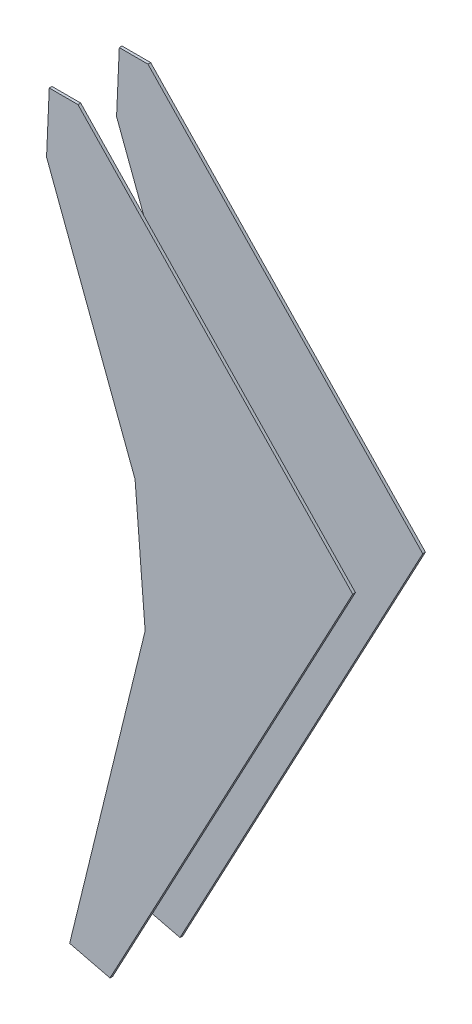
ISO-10303-21;
HEADER;
FILE_DESCRIPTION(('STEP AP214'),'2;1');
FILE_NAME('part.step','',(''),(''),'','','');
FILE_SCHEMA(('AUTOMOTIVE_DESIGN { 1 0 10303 214 1 1 1 1 }'));
ENDSEC;
DATA;
#1=APPLICATION_CONTEXT('core data for automotive mechanical design processes');
#2=APPLICATION_PROTOCOL_DEFINITION('international standard','automotive_design',2000,#1);
#3=PRODUCT_CONTEXT('',#1,'mechanical');
#4=PRODUCT('Part','Part','',(#3));
#5=PRODUCT_RELATED_PRODUCT_CATEGORY('part','',(#4));
#6=PRODUCT_DEFINITION_FORMATION('','',#4);
#7=PRODUCT_DEFINITION_CONTEXT('part definition',#1,'design');
#8=PRODUCT_DEFINITION('design','',#6,#7);
#9=PRODUCT_DEFINITION_SHAPE('','',#8);
#10=(LENGTH_UNIT() NAMED_UNIT(*) SI_UNIT(.MILLI.,.METRE.));
#11=(NAMED_UNIT(*) PLANE_ANGLE_UNIT() SI_UNIT($,.RADIAN.));
#12=(NAMED_UNIT(*) SI_UNIT($,.STERADIAN.) SOLID_ANGLE_UNIT());
#13=UNCERTAINTY_MEASURE_WITH_UNIT(LENGTH_MEASURE(1.E-05),#10,'distance_accuracy_value','');
#14=(GEOMETRIC_REPRESENTATION_CONTEXT(3) GLOBAL_UNCERTAINTY_ASSIGNED_CONTEXT((#13)) GLOBAL_UNIT_ASSIGNED_CONTEXT((#10,
#11,#12)) REPRESENTATION_CONTEXT('',''));
#15=CARTESIAN_POINT('',(0.,0.,0.));
#16=DIRECTION('',(0.,0.,1.));
#17=DIRECTION('',(1.,0.,0.));
#18=AXIS2_PLACEMENT_3D('',#15,#16,#17);
#19=CARTESIAN_POINT('',(-290.413622868876,715.062577472868,-70.25));
#20=DIRECTION('',(0.,1.,0.));
#21=DIRECTION('',(0.,0.,1.));
#22=AXIS2_PLACEMENT_3D('',#19,#20,#21);
#23=PLANE('',#22);
#24=DIRECTION('',(-1.,0.,0.));
#25=VECTOR('',#24,1.);
#26=CARTESIAN_POINT('',(-290.413622868876,715.062577472868,-65.));
#27=LINE('',#26,#25);
#28=CARTESIAN_POINT('',(-235.091721204549,715.062577472868,-65.));
#29=VERTEX_POINT('',#28);
#30=CARTESIAN_POINT('',(-290.413622868876,715.062577472868,-65.));
#31=VERTEX_POINT('',#30);
#32=EDGE_CURVE('E152',#29,#31,#27,.T.);
#33=ORIENTED_EDGE('',*,*,#32,.F.);
#34=DIRECTION('',(0.,0.,1.));
#35=VECTOR('',#34,1.);
#36=CARTESIAN_POINT('',(-235.091721204549,715.062577472868,-70.25));
#37=LINE('',#36,#35);
#38=CARTESIAN_POINT('',(-235.091721204549,715.062577472868,-70.25));
#39=VERTEX_POINT('',#38);
#40=EDGE_CURVE('E12',#39,#29,#37,.T.);
#41=ORIENTED_EDGE('',*,*,#40,.F.);
#42=DIRECTION('',(-1.,0.,0.));
#43=VECTOR('',#42,1.);
#44=CARTESIAN_POINT('',(-290.413622868876,715.062577472868,-70.25));
#45=LINE('',#44,#43);
#46=CARTESIAN_POINT('',(-290.413622868876,715.062577472868,-70.25));
#47=VERTEX_POINT('',#46);
#48=EDGE_CURVE('E180',#39,#47,#45,.T.);
#49=ORIENTED_EDGE('',*,*,#48,.T.);
#50=DIRECTION('',(0.,0.,1.));
#51=VECTOR('',#50,1.);
#52=CARTESIAN_POINT('',(-290.413622868876,715.062577472868,-70.25));
#53=LINE('',#52,#51);
#54=EDGE_CURVE('E52',#47,#31,#53,.T.);
#55=ORIENTED_EDGE('',*,*,#54,.T.);
#56=EDGE_LOOP('',(#33,#41,#49,#55));
#57=FACE_BOUND('',#56,.T.);
#58=ADVANCED_FACE('F49',(#57),#23,.T.);
#59=CARTESIAN_POINT('',(295.675074254291,161.480188614972,-70.25));
#60=DIRECTION('',(0.721825121904725,0.692075496883995,0.));
#61=DIRECTION('',(-0.692075496883995,0.721825121904725,0.));
#62=AXIS2_PLACEMENT_3D('',#59,#60,#61);
#63=PLANE('',#62);
#64=DIRECTION('',(-0.692075496883995,0.721825121904725,0.));
#65=VECTOR('',#64,1.);
#66=CARTESIAN_POINT('',(295.675074254291,161.480188614972,-65.));
#67=LINE('',#66,#65);
#68=CARTESIAN_POINT('',(295.675074254291,161.480188614972,-65.));
#69=VERTEX_POINT('',#68);
#70=EDGE_CURVE('E177',#69,#29,#67,.T.);
#71=ORIENTED_EDGE('',*,*,#70,.F.);
#72=DIRECTION('',(0.,0.,1.));
#73=VECTOR('',#72,1.);
#74=CARTESIAN_POINT('',(295.675074254291,161.480188614972,-70.25));
#75=LINE('',#74,#73);
#76=CARTESIAN_POINT('',(295.675074254291,161.480188614972,-70.25));
#77=VERTEX_POINT('',#76);
#78=EDGE_CURVE('E59',#77,#69,#75,.T.);
#79=ORIENTED_EDGE('',*,*,#78,.F.);
#80=DIRECTION('',(-0.692075496883995,0.721825121904725,0.));
#81=VECTOR('',#80,1.);
#82=CARTESIAN_POINT('',(295.675074254291,161.480188614972,-70.25));
#83=LINE('',#82,#81);
#84=EDGE_CURVE('E138',#77,#39,#83,.T.);
#85=ORIENTED_EDGE('',*,*,#84,.T.);
#86=ORIENTED_EDGE('',*,*,#40,.T.);
#87=EDGE_LOOP('',(#71,#79,#85,#86));
#88=FACE_BOUND('',#87,.T.);
#89=ADVANCED_FACE('F198',(#88),#63,.T.);
#90=CARTESIAN_POINT('',(-173.202657587621,-715.062577472868,-70.25));
#91=DIRECTION('',(0.881772393414626,-0.471675149029332,0.));
#92=DIRECTION('',(0.471675149029332,0.881772393414626,0.));
#93=AXIS2_PLACEMENT_3D('',#90,#91,#92);
#94=PLANE('',#93);
#95=DIRECTION('',(0.471675149029332,0.881772393414626,0.));
#96=VECTOR('',#95,1.);
#97=CARTESIAN_POINT('',(-173.202657587621,-715.062577472868,-65.));
#98=LINE('',#97,#96);
#99=CARTESIAN_POINT('',(-173.202657587621,-715.062577472868,-65.));
#100=VERTEX_POINT('',#99);
#101=EDGE_CURVE('E124',#100,#69,#98,.T.);
#102=ORIENTED_EDGE('',*,*,#101,.F.);
#103=DIRECTION('',(0.,0.,1.));
#104=VECTOR('',#103,1.);
#105=CARTESIAN_POINT('',(-173.202657587621,-715.062577472868,-70.25));
#106=LINE('',#105,#104);
#107=CARTESIAN_POINT('',(-173.202657587621,-715.062577472868,-70.25));
#108=VERTEX_POINT('',#107);
#109=EDGE_CURVE('E119',#108,#100,#106,.T.);
#110=ORIENTED_EDGE('',*,*,#109,.F.);
#111=DIRECTION('',(0.471675149029332,0.881772393414626,0.));
#112=VECTOR('',#111,1.);
#113=CARTESIAN_POINT('',(-173.202657587621,-715.062577472868,-70.25));
#114=LINE('',#113,#112);
#115=EDGE_CURVE('E122',#108,#77,#114,.T.);
#116=ORIENTED_EDGE('',*,*,#115,.T.);
#117=ORIENTED_EDGE('',*,*,#78,.T.);
#118=EDGE_LOOP('',(#102,#110,#116,#117));
#119=FACE_BOUND('',#118,.T.);
#120=ADVANCED_FACE('F121',(#119),#94,.T.);
#121=CARTESIAN_POINT('',(-251.026677890345,-696.013410022108,-70.25));
#122=DIRECTION('',(-0.237753613248927,-0.971325496106779,0.));
#123=DIRECTION('',(0.971325496106779,-0.237753613248927,0.));
#124=AXIS2_PLACEMENT_3D('',#121,#122,#123);
#125=PLANE('',#124);
#126=DIRECTION('',(0.971325496106779,-0.237753613248927,0.));
#127=VECTOR('',#126,1.);
#128=CARTESIAN_POINT('',(-251.026677890345,-696.013410022108,-65.));
#129=LINE('',#128,#127);
#130=CARTESIAN_POINT('',(-251.026677890345,-696.013410022108,-65.));
#131=VERTEX_POINT('',#130);
#132=EDGE_CURVE('E172',#131,#100,#129,.T.);
#133=ORIENTED_EDGE('',*,*,#132,.F.);
#134=DIRECTION('',(0.,0.,1.));
#135=VECTOR('',#134,1.);
#136=CARTESIAN_POINT('',(-251.026677890345,-696.013410022108,-70.25));
#137=LINE('',#136,#135);
#138=CARTESIAN_POINT('',(-251.026677890345,-696.013410022108,-70.25));
#139=VERTEX_POINT('',#138);
#140=EDGE_CURVE('E130',#139,#131,#137,.T.);
#141=ORIENTED_EDGE('',*,*,#140,.F.);
#142=DIRECTION('',(0.971325496106779,-0.237753613248927,0.));
#143=VECTOR('',#142,1.);
#144=CARTESIAN_POINT('',(-251.026677890345,-696.013410022108,-70.25));
#145=LINE('',#144,#143);
#146=EDGE_CURVE('E136',#139,#108,#145,.T.);
#147=ORIENTED_EDGE('',*,*,#146,.T.);
#148=ORIENTED_EDGE('',*,*,#109,.T.);
#149=EDGE_LOOP('',(#133,#141,#147,#148));
#150=FACE_BOUND('',#149,.T.);
#151=ADVANCED_FACE('F141',(#150),#125,.T.);
#152=CARTESIAN_POINT('',(-251.026677890345,-696.013410022108,-70.25));
#153=DIRECTION('',(-0.971325496106777,0.237753613248932,0.));
#154=DIRECTION('',(-0.237753613248933,-0.971325496106777,0.));
#155=AXIS2_PLACEMENT_3D('',#152,#153,#154);
#156=PLANE('',#155);
#157=DIRECTION('',(-0.237753613248932,-0.971325496106777,0.));
#158=VECTOR('',#157,1.);
#159=CARTESIAN_POINT('',(-251.026677890345,-696.013410022108,-65.));
#160=LINE('',#159,#158);
#161=CARTESIAN_POINT('',(-105.228202031788,-100.364094919385,-65.));
#162=VERTEX_POINT('',#161);
#163=EDGE_CURVE('E168',#162,#131,#160,.T.);
#164=ORIENTED_EDGE('',*,*,#163,.F.);
#165=DIRECTION('',(0.,0.,1.));
#166=VECTOR('',#165,1.);
#167=CARTESIAN_POINT('',(-105.228202031788,-100.364094919385,-70.25));
#168=LINE('',#167,#166);
#169=CARTESIAN_POINT('',(-105.228202031788,-100.364094919385,-70.25));
#170=VERTEX_POINT('',#169);
#171=EDGE_CURVE('E186',#170,#162,#168,.T.);
#172=ORIENTED_EDGE('',*,*,#171,.F.);
#173=DIRECTION('',(-0.237753613248932,-0.971325496106777,0.));
#174=VECTOR('',#173,1.);
#175=CARTESIAN_POINT('',(-251.026677890345,-696.013410022108,-70.25));
#176=LINE('',#175,#174);
#177=EDGE_CURVE('E143',#170,#139,#176,.T.);
#178=ORIENTED_EDGE('',*,*,#177,.T.);
#179=ORIENTED_EDGE('',*,*,#140,.T.);
#180=EDGE_LOOP('',(#164,#172,#178,#179));
#181=FACE_BOUND('',#180,.T.);
#182=ADVANCED_FACE('F211',(#181),#156,.T.);
#183=CARTESIAN_POINT('',(-124.723344844375,143.447345429365,-70.25));
#184=DIRECTION('',(-0.996818453765809,-0.0797055219664389,0.));
#185=DIRECTION('',(0.0797055219664389,-0.996818453765809,0.));
#186=AXIS2_PLACEMENT_3D('',#183,#184,#185);
#187=PLANE('',#186);
#188=DIRECTION('',(0.0797055219664389,-0.996818453765809,0.));
#189=VECTOR('',#188,1.);
#190=CARTESIAN_POINT('',(-124.723344844375,143.447345429365,-65.));
#191=LINE('',#190,#189);
#192=CARTESIAN_POINT('',(-124.723344844375,143.447345429365,-65.));
#193=VERTEX_POINT('',#192);
#194=EDGE_CURVE('E164',#193,#162,#191,.T.);
#195=ORIENTED_EDGE('',*,*,#194,.F.);
#196=DIRECTION('',(0.,0.,1.));
#197=VECTOR('',#196,1.);
#198=CARTESIAN_POINT('',(-124.723344844375,143.447345429365,-70.25));
#199=LINE('',#198,#197);
#200=CARTESIAN_POINT('',(-124.723344844375,143.447345429365,-70.25));
#201=VERTEX_POINT('',#200);
#202=EDGE_CURVE('E189',#201,#193,#199,.T.);
#203=ORIENTED_EDGE('',*,*,#202,.F.);
#204=DIRECTION('',(0.0797055219664389,-0.996818453765809,0.));
#205=VECTOR('',#204,1.);
#206=CARTESIAN_POINT('',(-124.723344844375,143.447345429365,-70.25));
#207=LINE('',#206,#205);
#208=EDGE_CURVE('E146',#201,#170,#207,.T.);
#209=ORIENTED_EDGE('',*,*,#208,.T.);
#210=ORIENTED_EDGE('',*,*,#171,.T.);
#211=EDGE_LOOP('',(#195,#203,#209,#210));
#212=FACE_BOUND('',#211,.T.);
#213=ADVANCED_FACE('F214',(#212),#187,.T.);
#214=CARTESIAN_POINT('',(-295.675074254291,596.92144357392,-70.25));
#215=DIRECTION('',(-0.935717929687217,-0.352749140412656,0.));
#216=DIRECTION('',(0.352749140412656,-0.935717929687217,0.));
#217=AXIS2_PLACEMENT_3D('',#214,#215,#216);
#218=PLANE('',#217);
#219=DIRECTION('',(0.352749140412656,-0.935717929687217,0.));
#220=VECTOR('',#219,1.);
#221=CARTESIAN_POINT('',(-295.675074254291,596.92144357392,-65.));
#222=LINE('',#221,#220);
#223=CARTESIAN_POINT('',(-295.675074254291,596.92144357392,-65.));
#224=VERTEX_POINT('',#223);
#225=EDGE_CURVE('E160',#224,#193,#222,.T.);
#226=ORIENTED_EDGE('',*,*,#225,.F.);
#227=DIRECTION('',(0.,0.,1.));
#228=VECTOR('',#227,1.);
#229=CARTESIAN_POINT('',(-295.675074254291,596.92144357392,-70.25));
#230=LINE('',#229,#228);
#231=CARTESIAN_POINT('',(-295.675074254291,596.92144357392,-70.25));
#232=VERTEX_POINT('',#231);
#233=EDGE_CURVE('E191',#232,#224,#230,.T.);
#234=ORIENTED_EDGE('',*,*,#233,.F.);
#235=DIRECTION('',(0.352749140412656,-0.935717929687217,0.));
#236=VECTOR('',#235,1.);
#237=CARTESIAN_POINT('',(-295.675074254291,596.92144357392,-70.25));
#238=LINE('',#237,#236);
#239=EDGE_CURVE('E289',#232,#201,#238,.T.);
#240=ORIENTED_EDGE('',*,*,#239,.T.);
#241=ORIENTED_EDGE('',*,*,#202,.T.);
#242=EDGE_LOOP('',(#226,#234,#240,#241));
#243=FACE_BOUND('',#242,.T.);
#244=ADVANCED_FACE('F218',(#243),#218,.T.);
#245=CARTESIAN_POINT('',(-295.675074254291,596.92144357392,-70.25));
#246=DIRECTION('',(-0.999009776080988,0.0444912046882872,0.));
#247=DIRECTION('',(-0.0444912046882872,-0.999009776080988,0.));
#248=AXIS2_PLACEMENT_3D('',#245,#246,#247);
#249=PLANE('',#248);
#250=DIRECTION('',(-0.0444912046882872,-0.999009776080988,0.));
#251=VECTOR('',#250,1.);
#252=CARTESIAN_POINT('',(-295.675074254291,596.92144357392,-65.));
#253=LINE('',#252,#251);
#254=EDGE_CURVE('E156',#31,#224,#253,.T.);
#255=ORIENTED_EDGE('',*,*,#254,.F.);
#256=ORIENTED_EDGE('',*,*,#54,.F.);
#257=DIRECTION('',(-0.0444912046882872,-0.999009776080988,0.));
#258=VECTOR('',#257,1.);
#259=CARTESIAN_POINT('',(-295.675074254291,596.92144357392,-70.25));
#260=LINE('',#259,#258);
#261=EDGE_CURVE('E292',#47,#232,#260,.T.);
#262=ORIENTED_EDGE('',*,*,#261,.T.);
#263=ORIENTED_EDGE('',*,*,#233,.T.);
#264=EDGE_LOOP('',(#255,#256,#262,#263));
#265=FACE_BOUND('',#264,.T.);
#266=ADVANCED_FACE('F195',(#265),#249,.T.);
#267=CARTESIAN_POINT('',(0.,0.,-70.25));
#268=DIRECTION('',(0.,0.,1.));
#269=DIRECTION('',(1.,0.,0.));
#270=AXIS2_PLACEMENT_3D('',#267,#268,#269);
#271=PLANE('',#270);
#272=ORIENTED_EDGE('',*,*,#48,.F.);
#273=ORIENTED_EDGE('',*,*,#84,.F.);
#274=ORIENTED_EDGE('',*,*,#115,.F.);
#275=ORIENTED_EDGE('',*,*,#146,.F.);
#276=ORIENTED_EDGE('',*,*,#177,.F.);
#277=ORIENTED_EDGE('',*,*,#208,.F.);
#278=ORIENTED_EDGE('',*,*,#239,.F.);
#279=ORIENTED_EDGE('',*,*,#261,.F.);
#280=EDGE_LOOP('',(#272,#273,#274,#275,#276,#277,#278,#279));
#281=FACE_BOUND('',#280,.T.);
#282=ADVANCED_FACE('F134',(#281),#271,.F.);
#283=CARTESIAN_POINT('',(0.,0.,-65.));
#284=DIRECTION('',(0.,0.,1.));
#285=DIRECTION('',(1.,0.,0.));
#286=AXIS2_PLACEMENT_3D('',#283,#284,#285);
#287=PLANE('',#286);
#288=ORIENTED_EDGE('',*,*,#32,.T.);
#289=ORIENTED_EDGE('',*,*,#254,.T.);
#290=ORIENTED_EDGE('',*,*,#225,.T.);
#291=ORIENTED_EDGE('',*,*,#194,.T.);
#292=ORIENTED_EDGE('',*,*,#163,.T.);
#293=ORIENTED_EDGE('',*,*,#132,.T.);
#294=ORIENTED_EDGE('',*,*,#101,.T.);
#295=ORIENTED_EDGE('',*,*,#70,.T.);
#296=EDGE_LOOP('',(#288,#289,#290,#291,#292,#293,#294,#295));
#297=FACE_BOUND('',#296,.T.);
#298=ADVANCED_FACE('F197',(#297),#287,.T.);
#299=CLOSED_SHELL('',(#58,#89,#120,#151,#182,#213,#244,#266,#282,#298));
#300=MANIFOLD_SOLID_BREP('B2',#299);
#301=CARTESIAN_POINT('',(-290.413622868876,715.062577472868,70.25));
#302=DIRECTION('',(0.,-1.,0.));
#303=DIRECTION('',(0.,0.,-1.));
#304=AXIS2_PLACEMENT_3D('',#301,#302,#303);
#305=PLANE('',#304);
#306=DIRECTION('',(-1.,0.,0.));
#307=VECTOR('',#306,1.);
#308=CARTESIAN_POINT('',(-290.413622868876,715.062577472868,65.));
#309=LINE('',#308,#307);
#310=CARTESIAN_POINT('',(-235.091721204549,715.062577472868,65.));
#311=VERTEX_POINT('',#310);
#312=CARTESIAN_POINT('',(-290.413622868876,715.062577472868,65.));
#313=VERTEX_POINT('',#312);
#314=EDGE_CURVE('E397',#311,#313,#309,.T.);
#315=ORIENTED_EDGE('',*,*,#314,.T.);
#316=DIRECTION('',(0.,0.,-1.));
#317=VECTOR('',#316,1.);
#318=CARTESIAN_POINT('',(-290.413622868876,715.062577472868,70.25));
#319=LINE('',#318,#317);
#320=CARTESIAN_POINT('',(-290.413622868876,715.062577472868,70.25));
#321=VERTEX_POINT('',#320);
#322=EDGE_CURVE('E47',#321,#313,#319,.T.);
#323=ORIENTED_EDGE('',*,*,#322,.F.);
#324=DIRECTION('',(-1.,0.,0.));
#325=VECTOR('',#324,1.);
#326=CARTESIAN_POINT('',(-290.413622868876,715.062577472868,70.25));
#327=LINE('',#326,#325);
#328=CARTESIAN_POINT('',(-235.091721204549,715.062577472868,70.25));
#329=VERTEX_POINT('',#328);
#330=EDGE_CURVE('E411',#329,#321,#327,.T.);
#331=ORIENTED_EDGE('',*,*,#330,.F.);
#332=DIRECTION('',(0.,0.,-1.));
#333=VECTOR('',#332,1.);
#334=CARTESIAN_POINT('',(-235.091721204549,715.062577472868,70.25));
#335=LINE('',#334,#333);
#336=EDGE_CURVE('E393',#329,#311,#335,.T.);
#337=ORIENTED_EDGE('',*,*,#336,.T.);
#338=EDGE_LOOP('',(#315,#323,#331,#337));
#339=FACE_BOUND('',#338,.T.);
#340=ADVANCED_FACE('F301',(#339),#305,.F.);
#341=CARTESIAN_POINT('',(-295.675074254291,596.92144357392,70.25));
#342=DIRECTION('',(0.999009776080988,-0.0444912046882872,0.));
#343=DIRECTION('',(0.0444912046882872,0.999009776080988,0.));
#344=AXIS2_PLACEMENT_3D('',#341,#342,#343);
#345=PLANE('',#344);
#346=DIRECTION('',(-0.0444912046882872,-0.999009776080988,0.));
#347=VECTOR('',#346,1.);
#348=CARTESIAN_POINT('',(-295.675074254291,596.92144357392,65.));
#349=LINE('',#348,#347);
#350=CARTESIAN_POINT('',(-295.675074254291,596.92144357392,65.));
#351=VERTEX_POINT('',#350);
#352=EDGE_CURVE('E400',#313,#351,#349,.T.);
#353=ORIENTED_EDGE('',*,*,#352,.T.);
#354=DIRECTION('',(0.,0.,-1.));
#355=VECTOR('',#354,1.);
#356=CARTESIAN_POINT('',(-295.675074254291,596.92144357392,70.25));
#357=LINE('',#356,#355);
#358=CARTESIAN_POINT('',(-295.675074254291,596.92144357392,70.25));
#359=VERTEX_POINT('',#358);
#360=EDGE_CURVE('E309',#359,#351,#357,.T.);
#361=ORIENTED_EDGE('',*,*,#360,.F.);
#362=DIRECTION('',(-0.0444912046882872,-0.999009776080988,0.));
#363=VECTOR('',#362,1.);
#364=CARTESIAN_POINT('',(-295.675074254291,596.92144357392,70.25));
#365=LINE('',#364,#363);
#366=EDGE_CURVE('E360',#321,#359,#365,.T.);
#367=ORIENTED_EDGE('',*,*,#366,.F.);
#368=ORIENTED_EDGE('',*,*,#322,.T.);
#369=EDGE_LOOP('',(#353,#361,#367,#368));
#370=FACE_BOUND('',#369,.T.);
#371=ADVANCED_FACE('F446',(#370),#345,.F.);
#372=CARTESIAN_POINT('',(-295.675074254291,596.92144357392,70.25));
#373=DIRECTION('',(0.935717929687217,0.352749140412656,0.));
#374=DIRECTION('',(-0.352749140412656,0.935717929687217,0.));
#375=AXIS2_PLACEMENT_3D('',#372,#373,#374);
#376=PLANE('',#375);
#377=DIRECTION('',(0.352749140412656,-0.935717929687217,0.));
#378=VECTOR('',#377,1.);
#379=CARTESIAN_POINT('',(-295.675074254291,596.92144357392,65.));
#380=LINE('',#379,#378);
#381=CARTESIAN_POINT('',(-124.723344844375,143.447345429365,65.));
#382=VERTEX_POINT('',#381);
#383=EDGE_CURVE('E402',#351,#382,#380,.T.);
#384=ORIENTED_EDGE('',*,*,#383,.T.);
#385=DIRECTION('',(0.,0.,-1.));
#386=VECTOR('',#385,1.);
#387=CARTESIAN_POINT('',(-124.723344844375,143.447345429365,70.25));
#388=LINE('',#387,#386);
#389=CARTESIAN_POINT('',(-124.723344844375,143.447345429365,70.25));
#390=VERTEX_POINT('',#389);
#391=EDGE_CURVE('E418',#390,#382,#388,.T.);
#392=ORIENTED_EDGE('',*,*,#391,.F.);
#393=DIRECTION('',(0.352749140412656,-0.935717929687217,0.));
#394=VECTOR('',#393,1.);
#395=CARTESIAN_POINT('',(-295.675074254291,596.92144357392,70.25));
#396=LINE('',#395,#394);
#397=EDGE_CURVE('E426',#359,#390,#396,.T.);
#398=ORIENTED_EDGE('',*,*,#397,.F.);
#399=ORIENTED_EDGE('',*,*,#360,.T.);
#400=EDGE_LOOP('',(#384,#392,#398,#399));
#401=FACE_BOUND('',#400,.T.);
#402=ADVANCED_FACE('F424',(#401),#376,.F.);
#403=CARTESIAN_POINT('',(-124.723344844375,143.447345429365,70.25));
#404=DIRECTION('',(0.996818453765809,0.0797055219664389,0.));
#405=DIRECTION('',(-0.0797055219664389,0.996818453765809,0.));
#406=AXIS2_PLACEMENT_3D('',#403,#404,#405);
#407=PLANE('',#406);
#408=DIRECTION('',(0.0797055219664389,-0.996818453765809,0.));
#409=VECTOR('',#408,1.);
#410=CARTESIAN_POINT('',(-124.723344844375,143.447345429365,65.));
#411=LINE('',#410,#409);
#412=CARTESIAN_POINT('',(-105.228202031788,-100.364094919385,65.));
#413=VERTEX_POINT('',#412);
#414=EDGE_CURVE('E404',#382,#413,#411,.T.);
#415=ORIENTED_EDGE('',*,*,#414,.T.);
#416=DIRECTION('',(0.,0.,-1.));
#417=VECTOR('',#416,1.);
#418=CARTESIAN_POINT('',(-105.228202031788,-100.364094919385,70.25));
#419=LINE('',#418,#417);
#420=CARTESIAN_POINT('',(-105.228202031788,-100.364094919385,70.25));
#421=VERTEX_POINT('',#420);
#422=EDGE_CURVE('E415',#421,#413,#419,.T.);
#423=ORIENTED_EDGE('',*,*,#422,.F.);
#424=DIRECTION('',(0.0797055219664389,-0.996818453765809,0.));
#425=VECTOR('',#424,1.);
#426=CARTESIAN_POINT('',(-124.723344844375,143.447345429365,70.25));
#427=LINE('',#426,#425);
#428=EDGE_CURVE('E438',#390,#421,#427,.T.);
#429=ORIENTED_EDGE('',*,*,#428,.F.);
#430=ORIENTED_EDGE('',*,*,#391,.T.);
#431=EDGE_LOOP('',(#415,#423,#429,#430));
#432=FACE_BOUND('',#431,.T.);
#433=ADVANCED_FACE('F434',(#432),#407,.F.);
#434=CARTESIAN_POINT('',(-251.026677890345,-696.013410022108,70.25));
#435=DIRECTION('',(0.971325496106777,-0.237753613248932,0.));
#436=DIRECTION('',(0.237753613248933,0.971325496106777,0.));
#437=AXIS2_PLACEMENT_3D('',#434,#435,#436);
#438=PLANE('',#437);
#439=DIRECTION('',(-0.237753613248932,-0.971325496106777,0.));
#440=VECTOR('',#439,1.);
#441=CARTESIAN_POINT('',(-251.026677890345,-696.013410022108,65.));
#442=LINE('',#441,#440);
#443=CARTESIAN_POINT('',(-251.026677890345,-696.013410022108,65.));
#444=VERTEX_POINT('',#443);
#445=EDGE_CURVE('E406',#413,#444,#442,.T.);
#446=ORIENTED_EDGE('',*,*,#445,.T.);
#447=DIRECTION('',(0.,0.,-1.));
#448=VECTOR('',#447,1.);
#449=CARTESIAN_POINT('',(-251.026677890345,-696.013410022108,70.25));
#450=LINE('',#449,#448);
#451=CARTESIAN_POINT('',(-251.026677890345,-696.013410022108,70.25));
#452=VERTEX_POINT('',#451);
#453=EDGE_CURVE('E388',#452,#444,#450,.T.);
#454=ORIENTED_EDGE('',*,*,#453,.F.);
#455=DIRECTION('',(-0.237753613248932,-0.971325496106777,0.));
#456=VECTOR('',#455,1.);
#457=CARTESIAN_POINT('',(-251.026677890345,-696.013410022108,70.25));
#458=LINE('',#457,#456);
#459=EDGE_CURVE('E379',#421,#452,#458,.T.);
#460=ORIENTED_EDGE('',*,*,#459,.F.);
#461=ORIENTED_EDGE('',*,*,#422,.T.);
#462=EDGE_LOOP('',(#446,#454,#460,#461));
#463=FACE_BOUND('',#462,.T.);
#464=ADVANCED_FACE('F437',(#463),#438,.F.);
#465=CARTESIAN_POINT('',(-251.026677890345,-696.013410022108,70.25));
#466=DIRECTION('',(0.237753613248927,0.971325496106779,0.));
#467=DIRECTION('',(-0.971325496106779,0.237753613248927,0.));
#468=AXIS2_PLACEMENT_3D('',#465,#466,#467);
#469=PLANE('',#468);
#470=DIRECTION('',(0.971325496106779,-0.237753613248927,0.));
#471=VECTOR('',#470,1.);
#472=CARTESIAN_POINT('',(-251.026677890345,-696.013410022108,65.));
#473=LINE('',#472,#471);
#474=CARTESIAN_POINT('',(-173.202657587621,-715.062577472868,65.));
#475=VERTEX_POINT('',#474);
#476=EDGE_CURVE('E387',#444,#475,#473,.T.);
#477=ORIENTED_EDGE('',*,*,#476,.T.);
#478=DIRECTION('',(0.,0.,-1.));
#479=VECTOR('',#478,1.);
#480=CARTESIAN_POINT('',(-173.202657587621,-715.062577472868,70.25));
#481=LINE('',#480,#479);
#482=CARTESIAN_POINT('',(-173.202657587621,-715.062577472868,70.25));
#483=VERTEX_POINT('',#482);
#484=EDGE_CURVE('E384',#483,#475,#481,.T.);
#485=ORIENTED_EDGE('',*,*,#484,.F.);
#486=DIRECTION('',(0.971325496106779,-0.237753613248927,0.));
#487=VECTOR('',#486,1.);
#488=CARTESIAN_POINT('',(-251.026677890345,-696.013410022108,70.25));
#489=LINE('',#488,#487);
#490=EDGE_CURVE('E373',#452,#483,#489,.T.);
#491=ORIENTED_EDGE('',*,*,#490,.F.);
#492=ORIENTED_EDGE('',*,*,#453,.T.);
#493=EDGE_LOOP('',(#477,#485,#491,#492));
#494=FACE_BOUND('',#493,.T.);
#495=ADVANCED_FACE('F385',(#494),#469,.F.);
#496=CARTESIAN_POINT('',(-173.202657587621,-715.062577472868,70.25));
#497=DIRECTION('',(-0.881772393414626,0.471675149029332,0.));
#498=DIRECTION('',(-0.471675149029332,-0.881772393414626,0.));
#499=AXIS2_PLACEMENT_3D('',#496,#497,#498);
#500=PLANE('',#499);
#501=DIRECTION('',(0.471675149029332,0.881772393414626,0.));
#502=VECTOR('',#501,1.);
#503=CARTESIAN_POINT('',(-173.202657587621,-715.062577472868,65.));
#504=LINE('',#503,#502);
#505=CARTESIAN_POINT('',(295.675074254291,161.480188614972,65.));
#506=VERTEX_POINT('',#505);
#507=EDGE_CURVE('E346',#475,#506,#504,.T.);
#508=ORIENTED_EDGE('',*,*,#507,.T.);
#509=DIRECTION('',(0.,0.,-1.));
#510=VECTOR('',#509,1.);
#511=CARTESIAN_POINT('',(295.675074254291,161.480188614972,70.25));
#512=LINE('',#511,#510);
#513=CARTESIAN_POINT('',(295.675074254291,161.480188614972,70.25));
#514=VERTEX_POINT('',#513);
#515=EDGE_CURVE('E389',#514,#506,#512,.T.);
#516=ORIENTED_EDGE('',*,*,#515,.F.);
#517=DIRECTION('',(0.471675149029332,0.881772393414626,0.));
#518=VECTOR('',#517,1.);
#519=CARTESIAN_POINT('',(-173.202657587621,-715.062577472868,70.25));
#520=LINE('',#519,#518);
#521=EDGE_CURVE('E377',#483,#514,#520,.T.);
#522=ORIENTED_EDGE('',*,*,#521,.F.);
#523=ORIENTED_EDGE('',*,*,#484,.T.);
#524=EDGE_LOOP('',(#508,#516,#522,#523));
#525=FACE_BOUND('',#524,.T.);
#526=ADVANCED_FACE('F391',(#525),#500,.F.);
#527=CARTESIAN_POINT('',(295.675074254291,161.480188614972,70.25));
#528=DIRECTION('',(-0.721825121904725,-0.692075496883995,0.));
#529=DIRECTION('',(0.692075496883995,-0.721825121904725,0.));
#530=AXIS2_PLACEMENT_3D('',#527,#528,#529);
#531=PLANE('',#530);
#532=DIRECTION('',(-0.692075496883995,0.721825121904725,0.));
#533=VECTOR('',#532,1.);
#534=CARTESIAN_POINT('',(295.675074254291,161.480188614972,65.));
#535=LINE('',#534,#533);
#536=EDGE_CURVE('E352',#506,#311,#535,.T.);
#537=ORIENTED_EDGE('',*,*,#536,.T.);
#538=ORIENTED_EDGE('',*,*,#336,.F.);
#539=DIRECTION('',(-0.692075496883995,0.721825121904725,0.));
#540=VECTOR('',#539,1.);
#541=CARTESIAN_POINT('',(295.675074254291,161.480188614972,70.25));
#542=LINE('',#541,#540);
#543=EDGE_CURVE('E317',#514,#329,#542,.T.);
#544=ORIENTED_EDGE('',*,*,#543,.F.);
#545=ORIENTED_EDGE('',*,*,#515,.T.);
#546=EDGE_LOOP('',(#537,#538,#544,#545));
#547=FACE_BOUND('',#546,.T.);
#548=ADVANCED_FACE('F462',(#547),#531,.F.);
#549=CARTESIAN_POINT('',(0.,0.,70.25));
#550=DIRECTION('',(0.,0.,1.));
#551=DIRECTION('',(1.,0.,0.));
#552=AXIS2_PLACEMENT_3D('',#549,#550,#551);
#553=PLANE('',#552);
#554=ORIENTED_EDGE('',*,*,#330,.T.);
#555=ORIENTED_EDGE('',*,*,#366,.T.);
#556=ORIENTED_EDGE('',*,*,#397,.T.);
#557=ORIENTED_EDGE('',*,*,#428,.T.);
#558=ORIENTED_EDGE('',*,*,#459,.T.);
#559=ORIENTED_EDGE('',*,*,#490,.T.);
#560=ORIENTED_EDGE('',*,*,#521,.T.);
#561=ORIENTED_EDGE('',*,*,#543,.T.);
#562=EDGE_LOOP('',(#554,#555,#556,#557,#558,#559,#560,#561));
#563=FACE_BOUND('',#562,.T.);
#564=ADVANCED_FACE('F375',(#563),#553,.T.);
#565=CARTESIAN_POINT('',(0.,0.,65.));
#566=DIRECTION('',(0.,0.,1.));
#567=DIRECTION('',(1.,0.,0.));
#568=AXIS2_PLACEMENT_3D('',#565,#566,#567);
#569=PLANE('',#568);
#570=ORIENTED_EDGE('',*,*,#314,.F.);
#571=ORIENTED_EDGE('',*,*,#536,.F.);
#572=ORIENTED_EDGE('',*,*,#507,.F.);
#573=ORIENTED_EDGE('',*,*,#476,.F.);
#574=ORIENTED_EDGE('',*,*,#445,.F.);
#575=ORIENTED_EDGE('',*,*,#414,.F.);
#576=ORIENTED_EDGE('',*,*,#383,.F.);
#577=ORIENTED_EDGE('',*,*,#352,.F.);
#578=EDGE_LOOP('',(#570,#571,#572,#573,#574,#575,#576,#577));
#579=FACE_BOUND('',#578,.T.);
#580=ADVANCED_FACE('F430',(#579),#569,.F.);
#581=CLOSED_SHELL('',(#340,#371,#402,#433,#464,#495,#526,#548,#564,#580));
#582=MANIFOLD_SOLID_BREP('B6',#581);
#583=ADVANCED_BREP_SHAPE_REPRESENTATION('',(#18,#300,#582),#14);
#584=SHAPE_DEFINITION_REPRESENTATION(#9,#583);
ENDSEC;
END-ISO-10303-21;
